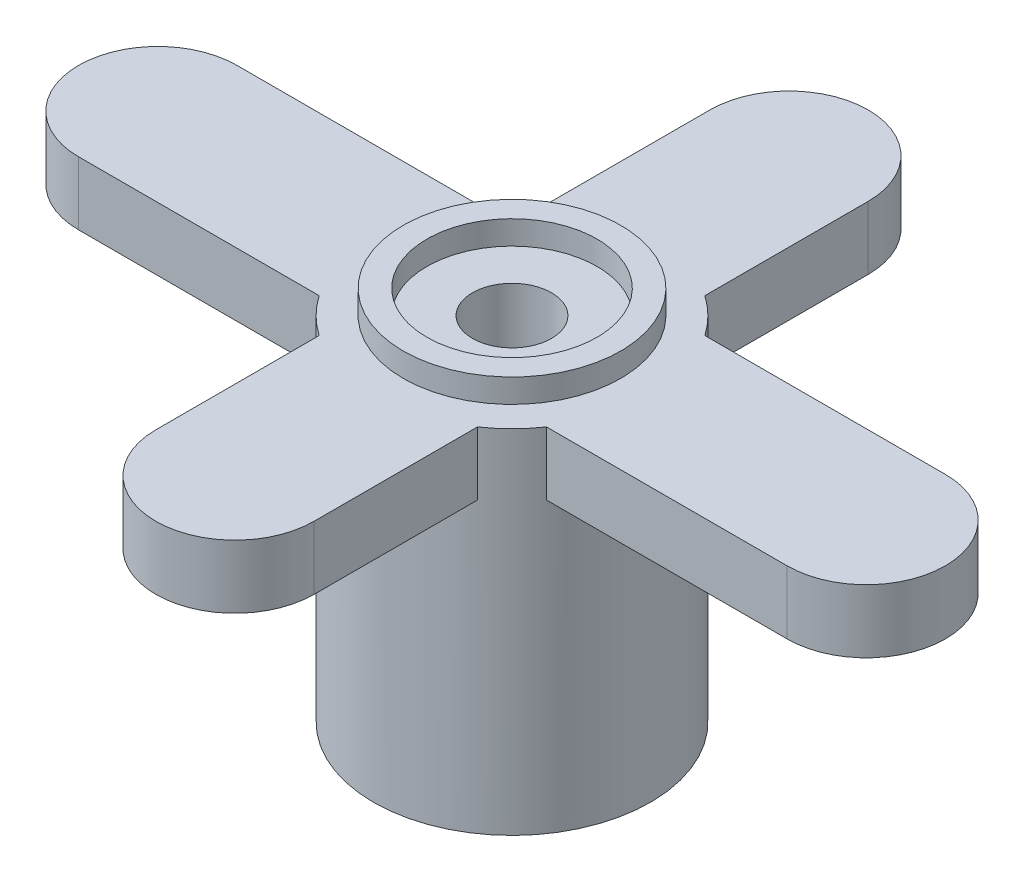
ISO-10303-21;
HEADER;
FILE_DESCRIPTION(('STEP AP214'),'2;1');
FILE_NAME('part.step','',(''),(''),'','','');
FILE_SCHEMA(('AUTOMOTIVE_DESIGN { 1 0 10303 214 1 1 1 1 }'));
ENDSEC;
DATA;
#1=APPLICATION_CONTEXT('core data for automotive mechanical design processes');
#2=APPLICATION_PROTOCOL_DEFINITION('international standard','automotive_design',2000,#1);
#3=PRODUCT_CONTEXT('',#1,'mechanical');
#4=PRODUCT('Part','Part','',(#3));
#5=PRODUCT_RELATED_PRODUCT_CATEGORY('part','',(#4));
#6=PRODUCT_DEFINITION_FORMATION('','',#4);
#7=PRODUCT_DEFINITION_CONTEXT('part definition',#1,'design');
#8=PRODUCT_DEFINITION('design','',#6,#7);
#9=PRODUCT_DEFINITION_SHAPE('','',#8);
#10=(LENGTH_UNIT() NAMED_UNIT(*) SI_UNIT(.MILLI.,.METRE.));
#11=(NAMED_UNIT(*) PLANE_ANGLE_UNIT() SI_UNIT($,.RADIAN.));
#12=(NAMED_UNIT(*) SI_UNIT($,.STERADIAN.) SOLID_ANGLE_UNIT());
#13=UNCERTAINTY_MEASURE_WITH_UNIT(LENGTH_MEASURE(1.E-05),#10,'distance_accuracy_value','');
#14=(GEOMETRIC_REPRESENTATION_CONTEXT(3) GLOBAL_UNCERTAINTY_ASSIGNED_CONTEXT((#13)) GLOBAL_UNIT_ASSIGNED_CONTEXT((#10,
#11,#12)) REPRESENTATION_CONTEXT('',''));
#15=CARTESIAN_POINT('',(0.,0.,0.));
#16=DIRECTION('',(0.,0.,1.));
#17=DIRECTION('',(1.,0.,0.));
#18=AXIS2_PLACEMENT_3D('',#15,#16,#17);
#19=CARTESIAN_POINT('',(0.,9.5,0.));
#20=DIRECTION('',(0.,-1.,0.));
#21=DIRECTION('',(0.,0.,-1.));
#22=AXIS2_PLACEMENT_3D('',#19,#20,#21);
#23=CYLINDRICAL_SURFACE('',#22,3.5);
#24=CARTESIAN_POINT('',(0.,0.,0.));
#25=DIRECTION('',(0.,1.,0.));
#26=DIRECTION('',(0.,0.,1.));
#27=AXIS2_PLACEMENT_3D('',#24,#25,#26);
#28=CIRCLE('',#27,3.5);
#29=CARTESIAN_POINT('',(0.,0.,3.5));
#30=VERTEX_POINT('',#29);
#31=EDGE_CURVE('E173',#30,#30,#28,.T.);
#32=ORIENTED_EDGE('',*,*,#31,.T.);
#33=EDGE_LOOP('',(#32));
#34=FACE_BOUND('',#33,.T.);
#35=CARTESIAN_POINT('',(0.,8.9,0.));
#36=DIRECTION('',(0.,1.,0.));
#37=DIRECTION('',(0.,0.,1.));
#38=AXIS2_PLACEMENT_3D('',#35,#36,#37);
#39=CIRCLE('',#38,3.5);
#40=CARTESIAN_POINT('',(2.87228132326901,8.9,2.));
#41=VERTEX_POINT('',#40);
#42=CARTESIAN_POINT('',(2.,8.9,2.87228132326901));
#43=VERTEX_POINT('',#42);
#44=EDGE_CURVE('E159',#41,#43,#39,.F.);
#45=ORIENTED_EDGE('',*,*,#44,.T.);
#46=DIRECTION('',(0.,-1.,0.));
#47=VECTOR('',#46,1.);
#48=CARTESIAN_POINT('',(2.,9.5,2.87228132326901));
#49=LINE('',#48,#47);
#50=CARTESIAN_POINT('',(2.,7.3,2.87228132326901));
#51=VERTEX_POINT('',#50);
#52=EDGE_CURVE('E198',#43,#51,#49,.T.);
#53=ORIENTED_EDGE('',*,*,#52,.T.);
#54=CARTESIAN_POINT('',(0.,7.3,0.));
#55=DIRECTION('',(0.,1.,0.));
#56=DIRECTION('',(0.,0.,1.));
#57=AXIS2_PLACEMENT_3D('',#54,#55,#56);
#58=CIRCLE('',#57,3.5);
#59=CARTESIAN_POINT('',(-2.,7.3,2.87228132326901));
#60=VERTEX_POINT('',#59);
#61=EDGE_CURVE('E11',#60,#51,#58,.T.);
#62=ORIENTED_EDGE('',*,*,#61,.F.);
#63=DIRECTION('',(0.,-1.,0.));
#64=VECTOR('',#63,1.);
#65=CARTESIAN_POINT('',(-2.,9.5,2.87228132326901));
#66=LINE('',#65,#64);
#67=CARTESIAN_POINT('',(-2.,8.9,2.87228132326901));
#68=VERTEX_POINT('',#67);
#69=EDGE_CURVE('E41',#68,#60,#66,.T.);
#70=ORIENTED_EDGE('',*,*,#69,.F.);
#71=CARTESIAN_POINT('',(-2.87228132326901,8.9,2.));
#72=VERTEX_POINT('',#71);
#73=EDGE_CURVE('E148',#68,#72,#39,.F.);
#74=ORIENTED_EDGE('',*,*,#73,.T.);
#75=DIRECTION('',(0.,-1.,0.));
#76=VECTOR('',#75,1.);
#77=CARTESIAN_POINT('',(-2.87228132326901,9.5,2.));
#78=LINE('',#77,#76);
#79=CARTESIAN_POINT('',(-2.87228132326901,7.3,2.));
#80=VERTEX_POINT('',#79);
#81=EDGE_CURVE('E151',#72,#80,#78,.T.);
#82=ORIENTED_EDGE('',*,*,#81,.T.);
#83=CARTESIAN_POINT('',(0.,7.3,0.));
#84=DIRECTION('',(0.,1.,0.));
#85=DIRECTION('',(0.,0.,1.));
#86=AXIS2_PLACEMENT_3D('',#83,#84,#85);
#87=CIRCLE('',#86,3.5);
#88=CARTESIAN_POINT('',(-2.87228132326901,7.3,-2.));
#89=VERTEX_POINT('',#88);
#90=EDGE_CURVE('E48',#89,#80,#87,.T.);
#91=ORIENTED_EDGE('',*,*,#90,.F.);
#92=DIRECTION('',(0.,-1.,0.));
#93=VECTOR('',#92,1.);
#94=CARTESIAN_POINT('',(-2.87228132326901,9.5,-2.));
#95=LINE('',#94,#93);
#96=CARTESIAN_POINT('',(-2.87228132326901,8.9,-2.));
#97=VERTEX_POINT('',#96);
#98=EDGE_CURVE('E56',#97,#89,#95,.T.);
#99=ORIENTED_EDGE('',*,*,#98,.F.);
#100=CARTESIAN_POINT('',(-2.,8.9,-2.87228132326901));
#101=VERTEX_POINT('',#100);
#102=EDGE_CURVE('E157',#97,#101,#39,.F.);
#103=ORIENTED_EDGE('',*,*,#102,.T.);
#104=DIRECTION('',(0.,-1.,0.));
#105=VECTOR('',#104,1.);
#106=CARTESIAN_POINT('',(-2.,9.5,-2.87228132326901));
#107=LINE('',#106,#105);
#108=CARTESIAN_POINT('',(-2.,7.3,-2.87228132326901));
#109=VERTEX_POINT('',#108);
#110=EDGE_CURVE('E182',#109,#101,#107,.F.);
#111=ORIENTED_EDGE('',*,*,#110,.F.);
#112=CARTESIAN_POINT('',(0.,7.3,0.));
#113=DIRECTION('',(0.,1.,0.));
#114=DIRECTION('',(0.,0.,1.));
#115=AXIS2_PLACEMENT_3D('',#112,#113,#114);
#116=CIRCLE('',#115,3.5);
#117=CARTESIAN_POINT('',(2.,7.3,-2.87228132326901));
#118=VERTEX_POINT('',#117);
#119=EDGE_CURVE('E188',#118,#109,#116,.T.);
#120=ORIENTED_EDGE('',*,*,#119,.F.);
#121=DIRECTION('',(0.,-1.,0.));
#122=VECTOR('',#121,1.);
#123=CARTESIAN_POINT('',(2.,9.5,-2.87228132326901));
#124=LINE('',#123,#122);
#125=CARTESIAN_POINT('',(2.,8.9,-2.87228132326901));
#126=VERTEX_POINT('',#125);
#127=EDGE_CURVE('E185',#118,#126,#124,.F.);
#128=ORIENTED_EDGE('',*,*,#127,.T.);
#129=CARTESIAN_POINT('',(2.87228132326901,8.9,-2.));
#130=VERTEX_POINT('',#129);
#131=EDGE_CURVE('E397',#126,#130,#39,.F.);
#132=ORIENTED_EDGE('',*,*,#131,.T.);
#133=DIRECTION('',(0.,-1.,0.));
#134=VECTOR('',#133,1.);
#135=CARTESIAN_POINT('',(2.87228132326901,9.5,-2.));
#136=LINE('',#135,#134);
#137=CARTESIAN_POINT('',(2.87228132326901,7.3,-2.));
#138=VERTEX_POINT('',#137);
#139=EDGE_CURVE('E190',#138,#130,#136,.F.);
#140=ORIENTED_EDGE('',*,*,#139,.F.);
#141=CARTESIAN_POINT('',(0.,7.3,0.));
#142=DIRECTION('',(0.,1.,0.));
#143=DIRECTION('',(0.,0.,1.));
#144=AXIS2_PLACEMENT_3D('',#141,#142,#143);
#145=CIRCLE('',#144,3.5);
#146=CARTESIAN_POINT('',(2.87228132326901,7.3,2.));
#147=VERTEX_POINT('',#146);
#148=EDGE_CURVE('E196',#147,#138,#145,.T.);
#149=ORIENTED_EDGE('',*,*,#148,.F.);
#150=DIRECTION('',(0.,-1.,0.));
#151=VECTOR('',#150,1.);
#152=CARTESIAN_POINT('',(2.87228132326901,9.5,2.));
#153=LINE('',#152,#151);
#154=EDGE_CURVE('E193',#147,#41,#153,.F.);
#155=ORIENTED_EDGE('',*,*,#154,.T.);
#156=EDGE_LOOP('',(#45,#53,#62,#70,#74,#82,#91,#99,#103,#111,#120,#128,#132,#140,#149,#155));
#157=FACE_BOUND('',#156,.T.);
#158=ADVANCED_FACE('F34',(#34,#157),#23,.T.);
#159=CARTESIAN_POINT('',(0.,9.5,0.));
#160=DIRECTION('',(0.,1.,0.));
#161=DIRECTION('',(0.,0.,1.));
#162=AXIS2_PLACEMENT_3D('',#159,#160,#161);
#163=PLANE('',#162);
#164=CARTESIAN_POINT('',(0.,9.5,0.));
#165=DIRECTION('',(0.,1.,0.));
#166=DIRECTION('',(0.,0.,1.));
#167=AXIS2_PLACEMENT_3D('',#164,#165,#166);
#168=CIRCLE('',#167,2.15);
#169=CARTESIAN_POINT('',(0.,9.5,2.15));
#170=VERTEX_POINT('',#169);
#171=EDGE_CURVE('E406',#170,#170,#168,.T.);
#172=ORIENTED_EDGE('',*,*,#171,.F.);
#173=EDGE_LOOP('',(#172));
#174=FACE_BOUND('',#173,.T.);
#175=CARTESIAN_POINT('',(0.,9.5,0.));
#176=DIRECTION('',(0.,1.,0.));
#177=DIRECTION('',(0.,0.,1.));
#178=AXIS2_PLACEMENT_3D('',#175,#176,#177);
#179=CIRCLE('',#178,2.75);
#180=CARTESIAN_POINT('',(0.,9.5,2.75));
#181=VERTEX_POINT('',#180);
#182=EDGE_CURVE('E395',#181,#181,#179,.T.);
#183=ORIENTED_EDGE('',*,*,#182,.T.);
#184=EDGE_LOOP('',(#183));
#185=FACE_BOUND('',#184,.T.);
#186=ADVANCED_FACE('F296',(#174,#185),#163,.T.);
#187=CARTESIAN_POINT('',(0.,0.,0.));
#188=DIRECTION('',(0.,1.,0.));
#189=DIRECTION('',(0.,0.,1.));
#190=AXIS2_PLACEMENT_3D('',#187,#188,#189);
#191=PLANE('',#190);
#192=CARTESIAN_POINT('',(0.,0.,0.));
#193=DIRECTION('',(0.,-1.,0.));
#194=DIRECTION('',(0.,0.,-1.));
#195=AXIS2_PLACEMENT_3D('',#192,#193,#194);
#196=CIRCLE('',#195,1.9);
#197=CARTESIAN_POINT('',(0.,0.,-1.9));
#198=VERTEX_POINT('',#197);
#199=EDGE_CURVE('E285',#198,#198,#196,.T.);
#200=ORIENTED_EDGE('',*,*,#199,.F.);
#201=EDGE_LOOP('',(#200));
#202=FACE_BOUND('',#201,.T.);
#203=ORIENTED_EDGE('',*,*,#31,.F.);
#204=EDGE_LOOP('',(#203));
#205=FACE_BOUND('',#204,.T.);
#206=ADVANCED_FACE('F293',(#202,#205),#191,.F.);
#207=CARTESIAN_POINT('',(0.,3.5,0.));
#208=DIRECTION('',(0.,-1.,0.));
#209=DIRECTION('',(0.,0.,-1.));
#210=AXIS2_PLACEMENT_3D('',#207,#208,#209);
#211=CYLINDRICAL_SURFACE('',#210,1.9);
#212=CARTESIAN_POINT('',(0.,3.5,0.));
#213=DIRECTION('',(0.,-1.,0.));
#214=DIRECTION('',(0.,0.,-1.));
#215=AXIS2_PLACEMENT_3D('',#212,#213,#214);
#216=CIRCLE('',#215,1.9);
#217=CARTESIAN_POINT('',(0.,3.5,-1.9));
#218=VERTEX_POINT('',#217);
#219=EDGE_CURVE('E177',#218,#218,#216,.T.);
#220=ORIENTED_EDGE('',*,*,#219,.F.);
#221=EDGE_LOOP('',(#220));
#222=FACE_BOUND('',#221,.T.);
#223=ORIENTED_EDGE('',*,*,#199,.T.);
#224=EDGE_LOOP('',(#223));
#225=FACE_BOUND('',#224,.T.);
#226=ADVANCED_FACE('F291',(#222,#225),#211,.F.);
#227=CARTESIAN_POINT('',(0.,3.5,0.));
#228=DIRECTION('',(0.,-1.,0.));
#229=DIRECTION('',(0.,0.,-1.));
#230=AXIS2_PLACEMENT_3D('',#227,#228,#229);
#231=PLANE('',#230);
#232=CARTESIAN_POINT('',(0.,3.5,0.));
#233=DIRECTION('',(0.,-1.,0.));
#234=DIRECTION('',(0.,0.,-1.));
#235=AXIS2_PLACEMENT_3D('',#232,#233,#234);
#236=CIRCLE('',#235,1.);
#237=CARTESIAN_POINT('',(0.,3.5,-1.));
#238=VERTEX_POINT('',#237);
#239=EDGE_CURVE('E403',#238,#238,#236,.T.);
#240=ORIENTED_EDGE('',*,*,#239,.F.);
#241=EDGE_LOOP('',(#240));
#242=FACE_BOUND('',#241,.T.);
#243=ORIENTED_EDGE('',*,*,#219,.T.);
#244=EDGE_LOOP('',(#243));
#245=FACE_BOUND('',#244,.T.);
#246=ADVANCED_FACE('F312',(#242,#245),#231,.T.);
#247=CARTESIAN_POINT('',(0.,7.3,-2.));
#248=DIRECTION('',(0.,0.,1.));
#249=DIRECTION('',(1.,0.,0.));
#250=AXIS2_PLACEMENT_3D('',#247,#248,#249);
#251=PLANE('',#250);
#252=DIRECTION('',(1.,0.,0.));
#253=VECTOR('',#252,1.);
#254=CARTESIAN_POINT('',(0.,8.9,-2.));
#255=LINE('',#254,#253);
#256=CARTESIAN_POINT('',(-8.95,8.9,-2.));
#257=VERTEX_POINT('',#256);
#258=EDGE_CURVE('E169',#257,#97,#255,.T.);
#259=ORIENTED_EDGE('',*,*,#258,.T.);
#260=ORIENTED_EDGE('',*,*,#98,.T.);
#261=DIRECTION('',(1.,0.,0.));
#262=VECTOR('',#261,1.);
#263=CARTESIAN_POINT('',(0.,7.3,-2.));
#264=LINE('',#263,#262);
#265=CARTESIAN_POINT('',(-8.95,7.3,-2.));
#266=VERTEX_POINT('',#265);
#267=EDGE_CURVE('E278',#266,#89,#264,.T.);
#268=ORIENTED_EDGE('',*,*,#267,.F.);
#269=DIRECTION('',(0.,1.,0.));
#270=VECTOR('',#269,1.);
#271=CARTESIAN_POINT('',(-8.95,7.3,-2.));
#272=LINE('',#271,#270);
#273=EDGE_CURVE('E283',#266,#257,#272,.T.);
#274=ORIENTED_EDGE('',*,*,#273,.T.);
#275=EDGE_LOOP('',(#259,#260,#268,#274));
#276=FACE_BOUND('',#275,.T.);
#277=ADVANCED_FACE('F316',(#276),#251,.F.);
#278=CARTESIAN_POINT('',(0.,7.3,2.));
#279=DIRECTION('',(0.,0.,1.));
#280=DIRECTION('',(1.,0.,0.));
#281=AXIS2_PLACEMENT_3D('',#278,#279,#280);
#282=PLANE('',#281);
#283=ORIENTED_EDGE('',*,*,#81,.F.);
#284=DIRECTION('',(1.,0.,0.));
#285=VECTOR('',#284,1.);
#286=CARTESIAN_POINT('',(0.,8.9,2.));
#287=LINE('',#286,#285);
#288=CARTESIAN_POINT('',(-8.95,8.9,2.));
#289=VERTEX_POINT('',#288);
#290=EDGE_CURVE('E162',#289,#72,#287,.T.);
#291=ORIENTED_EDGE('',*,*,#290,.F.);
#292=DIRECTION('',(0.,1.,0.));
#293=VECTOR('',#292,1.);
#294=CARTESIAN_POINT('',(-8.95,7.3,2.));
#295=LINE('',#294,#293);
#296=CARTESIAN_POINT('',(-8.95,7.3,2.));
#297=VERTEX_POINT('',#296);
#298=EDGE_CURVE('E280',#297,#289,#295,.T.);
#299=ORIENTED_EDGE('',*,*,#298,.F.);
#300=DIRECTION('',(1.,0.,0.));
#301=VECTOR('',#300,1.);
#302=CARTESIAN_POINT('',(0.,7.3,2.));
#303=LINE('',#302,#301);
#304=EDGE_CURVE('E172',#297,#80,#303,.T.);
#305=ORIENTED_EDGE('',*,*,#304,.T.);
#306=EDGE_LOOP('',(#283,#291,#299,#305));
#307=FACE_BOUND('',#306,.T.);
#308=ADVANCED_FACE('F171',(#307),#282,.T.);
#309=CARTESIAN_POINT('',(-8.95,7.3,0.));
#310=DIRECTION('',(0.,1.,0.));
#311=DIRECTION('',(0.,0.,1.));
#312=AXIS2_PLACEMENT_3D('',#309,#310,#311);
#313=CYLINDRICAL_SURFACE('',#312,2.);
#314=CARTESIAN_POINT('',(-8.95,8.9,0.));
#315=DIRECTION('',(0.,1.,0.));
#316=DIRECTION('',(0.,0.,1.));
#317=AXIS2_PLACEMENT_3D('',#314,#315,#316);
#318=CIRCLE('',#317,2.);
#319=EDGE_CURVE('E167',#257,#289,#318,.T.);
#320=ORIENTED_EDGE('',*,*,#319,.F.);
#321=ORIENTED_EDGE('',*,*,#273,.F.);
#322=CARTESIAN_POINT('',(-8.95,7.3,0.));
#323=DIRECTION('',(0.,1.,0.));
#324=DIRECTION('',(0.,0.,1.));
#325=AXIS2_PLACEMENT_3D('',#322,#323,#324);
#326=CIRCLE('',#325,2.);
#327=EDGE_CURVE('E274',#266,#297,#326,.T.);
#328=ORIENTED_EDGE('',*,*,#327,.T.);
#329=ORIENTED_EDGE('',*,*,#298,.T.);
#330=EDGE_LOOP('',(#320,#321,#328,#329));
#331=FACE_BOUND('',#330,.T.);
#332=ADVANCED_FACE('F318',(#331),#313,.T.);
#333=CARTESIAN_POINT('',(0.,7.3,0.));
#334=DIRECTION('',(0.,1.,0.));
#335=DIRECTION('',(0.,0.,1.));
#336=AXIS2_PLACEMENT_3D('',#333,#334,#335);
#337=PLANE('',#336);
#338=ORIENTED_EDGE('',*,*,#267,.T.);
#339=ORIENTED_EDGE('',*,*,#90,.T.);
#340=ORIENTED_EDGE('',*,*,#304,.F.);
#341=ORIENTED_EDGE('',*,*,#327,.F.);
#342=EDGE_LOOP('',(#338,#339,#340,#341));
#343=FACE_BOUND('',#342,.T.);
#344=ADVANCED_FACE('F321',(#343),#337,.F.);
#345=CARTESIAN_POINT('',(0.,8.9,0.));
#346=DIRECTION('',(0.,1.,0.));
#347=DIRECTION('',(0.,0.,1.));
#348=AXIS2_PLACEMENT_3D('',#345,#346,#347);
#349=PLANE('',#348);
#350=ORIENTED_EDGE('',*,*,#290,.T.);
#351=ORIENTED_EDGE('',*,*,#73,.F.);
#352=DIRECTION('',(0.,0.,-1.));
#353=VECTOR('',#352,1.);
#354=CARTESIAN_POINT('',(-2.,8.9,0.));
#355=LINE('',#354,#353);
#356=CARTESIAN_POINT('',(-2.,8.9,7.));
#357=VERTEX_POINT('',#356);
#358=EDGE_CURVE('E206',#357,#68,#355,.T.);
#359=ORIENTED_EDGE('',*,*,#358,.F.);
#360=CARTESIAN_POINT('',(0.,8.9,7.));
#361=DIRECTION('',(0.,1.,0.));
#362=DIRECTION('',(0.,0.,1.));
#363=AXIS2_PLACEMENT_3D('',#360,#361,#362);
#364=CIRCLE('',#363,2.);
#365=CARTESIAN_POINT('',(2.,8.9,7.));
#366=VERTEX_POINT('',#365);
#367=EDGE_CURVE('E213',#357,#366,#364,.T.);
#368=ORIENTED_EDGE('',*,*,#367,.T.);
#369=DIRECTION('',(0.,0.,-1.));
#370=VECTOR('',#369,1.);
#371=CARTESIAN_POINT('',(2.,8.9,0.));
#372=LINE('',#371,#370);
#373=EDGE_CURVE('E221',#366,#43,#372,.T.);
#374=ORIENTED_EDGE('',*,*,#373,.T.);
#375=ORIENTED_EDGE('',*,*,#44,.F.);
#376=DIRECTION('',(1.,0.,0.));
#377=VECTOR('',#376,1.);
#378=CARTESIAN_POINT('',(0.,8.9,2.));
#379=LINE('',#378,#377);
#380=CARTESIAN_POINT('',(8.95,8.9,2.));
#381=VERTEX_POINT('',#380);
#382=EDGE_CURVE('E249',#41,#381,#379,.T.);
#383=ORIENTED_EDGE('',*,*,#382,.T.);
#384=CARTESIAN_POINT('',(8.95,8.9,0.));
#385=DIRECTION('',(0.,1.,0.));
#386=DIRECTION('',(0.,0.,1.));
#387=AXIS2_PLACEMENT_3D('',#384,#385,#386);
#388=CIRCLE('',#387,2.);
#389=CARTESIAN_POINT('',(8.95,8.9,-2.));
#390=VERTEX_POINT('',#389);
#391=EDGE_CURVE('E245',#381,#390,#388,.T.);
#392=ORIENTED_EDGE('',*,*,#391,.T.);
#393=DIRECTION('',(1.,0.,0.));
#394=VECTOR('',#393,1.);
#395=CARTESIAN_POINT('',(0.,8.9,-2.));
#396=LINE('',#395,#394);
#397=EDGE_CURVE('E238',#130,#390,#396,.T.);
#398=ORIENTED_EDGE('',*,*,#397,.F.);
#399=ORIENTED_EDGE('',*,*,#131,.F.);
#400=DIRECTION('',(0.,0.,-1.));
#401=VECTOR('',#400,1.);
#402=CARTESIAN_POINT('',(2.,8.9,0.));
#403=LINE('',#402,#401);
#404=CARTESIAN_POINT('',(2.,8.9,-7.));
#405=VERTEX_POINT('',#404);
#406=EDGE_CURVE('E268',#126,#405,#403,.T.);
#407=ORIENTED_EDGE('',*,*,#406,.T.);
#408=CARTESIAN_POINT('',(0.,8.9,-7.));
#409=DIRECTION('',(0.,1.,0.));
#410=DIRECTION('',(0.,0.,1.));
#411=AXIS2_PLACEMENT_3D('',#408,#409,#410);
#412=CIRCLE('',#411,2.);
#413=CARTESIAN_POINT('',(-2.,8.9,-7.));
#414=VERTEX_POINT('',#413);
#415=EDGE_CURVE('E265',#405,#414,#412,.T.);
#416=ORIENTED_EDGE('',*,*,#415,.T.);
#417=DIRECTION('',(0.,0.,-1.));
#418=VECTOR('',#417,1.);
#419=CARTESIAN_POINT('',(-2.,8.9,0.));
#420=LINE('',#419,#418);
#421=EDGE_CURVE('E258',#101,#414,#420,.T.);
#422=ORIENTED_EDGE('',*,*,#421,.F.);
#423=ORIENTED_EDGE('',*,*,#102,.F.);
#424=ORIENTED_EDGE('',*,*,#258,.F.);
#425=ORIENTED_EDGE('',*,*,#319,.T.);
#426=EDGE_LOOP('',(#350,#351,#359,#368,#374,#375,#383,#392,#398,#399,#407,#416,#422,#423,#424,#425));
#427=FACE_BOUND('',#426,.T.);
#428=CARTESIAN_POINT('',(0.,8.9,0.));
#429=DIRECTION('',(0.,1.,0.));
#430=DIRECTION('',(0.,0.,1.));
#431=AXIS2_PLACEMENT_3D('',#428,#429,#430);
#432=CIRCLE('',#431,2.75);
#433=CARTESIAN_POINT('',(0.,8.9,2.75));
#434=VERTEX_POINT('',#433);
#435=EDGE_CURVE('E156',#434,#434,#432,.F.);
#436=ORIENTED_EDGE('',*,*,#435,.T.);
#437=EDGE_LOOP('',(#436));
#438=FACE_BOUND('',#437,.T.);
#439=ADVANCED_FACE('F163',(#427,#438),#349,.T.);
#440=CARTESIAN_POINT('',(2.,7.3,0.));
#441=DIRECTION('',(1.,0.,0.));
#442=DIRECTION('',(0.,0.,-1.));
#443=AXIS2_PLACEMENT_3D('',#440,#441,#442);
#444=PLANE('',#443);
#445=ORIENTED_EDGE('',*,*,#127,.F.);
#446=DIRECTION('',(0.,0.,-1.));
#447=VECTOR('',#446,1.);
#448=CARTESIAN_POINT('',(2.,7.3,0.));
#449=LINE('',#448,#447);
#450=CARTESIAN_POINT('',(2.,7.3,-7.));
#451=VERTEX_POINT('',#450);
#452=EDGE_CURVE('E248',#118,#451,#449,.T.);
#453=ORIENTED_EDGE('',*,*,#452,.T.);
#454=DIRECTION('',(0.,1.,0.));
#455=VECTOR('',#454,1.);
#456=CARTESIAN_POINT('',(2.,7.3,-7.));
#457=LINE('',#456,#455);
#458=EDGE_CURVE('E255',#451,#405,#457,.T.);
#459=ORIENTED_EDGE('',*,*,#458,.T.);
#460=ORIENTED_EDGE('',*,*,#406,.F.);
#461=EDGE_LOOP('',(#445,#453,#459,#460));
#462=FACE_BOUND('',#461,.T.);
#463=ADVANCED_FACE('F329',(#462),#444,.T.);
#464=CARTESIAN_POINT('',(-2.,7.3,0.));
#465=DIRECTION('',(1.,0.,0.));
#466=DIRECTION('',(0.,0.,-1.));
#467=AXIS2_PLACEMENT_3D('',#464,#465,#466);
#468=PLANE('',#467);
#469=DIRECTION('',(0.,0.,-1.));
#470=VECTOR('',#469,1.);
#471=CARTESIAN_POINT('',(-2.,7.3,0.));
#472=LINE('',#471,#470);
#473=CARTESIAN_POINT('',(-2.,7.3,-7.));
#474=VERTEX_POINT('',#473);
#475=EDGE_CURVE('E262',#109,#474,#472,.T.);
#476=ORIENTED_EDGE('',*,*,#475,.F.);
#477=ORIENTED_EDGE('',*,*,#110,.T.);
#478=ORIENTED_EDGE('',*,*,#421,.T.);
#479=DIRECTION('',(0.,1.,0.));
#480=VECTOR('',#479,1.);
#481=CARTESIAN_POINT('',(-2.,7.3,-7.));
#482=LINE('',#481,#480);
#483=EDGE_CURVE('E259',#474,#414,#482,.T.);
#484=ORIENTED_EDGE('',*,*,#483,.F.);
#485=EDGE_LOOP('',(#476,#477,#478,#484));
#486=FACE_BOUND('',#485,.T.);
#487=ADVANCED_FACE('F338',(#486),#468,.F.);
#488=CARTESIAN_POINT('',(0.,7.3,-7.));
#489=DIRECTION('',(0.,1.,0.));
#490=DIRECTION('',(0.,0.,1.));
#491=AXIS2_PLACEMENT_3D('',#488,#489,#490);
#492=CYLINDRICAL_SURFACE('',#491,2.);
#493=ORIENTED_EDGE('',*,*,#415,.F.);
#494=ORIENTED_EDGE('',*,*,#458,.F.);
#495=CARTESIAN_POINT('',(0.,7.3,-7.));
#496=DIRECTION('',(0.,1.,0.));
#497=DIRECTION('',(0.,0.,1.));
#498=AXIS2_PLACEMENT_3D('',#495,#496,#497);
#499=CIRCLE('',#498,2.);
#500=EDGE_CURVE('E263',#451,#474,#499,.T.);
#501=ORIENTED_EDGE('',*,*,#500,.T.);
#502=ORIENTED_EDGE('',*,*,#483,.T.);
#503=EDGE_LOOP('',(#493,#494,#501,#502));
#504=FACE_BOUND('',#503,.T.);
#505=ADVANCED_FACE('F336',(#504),#492,.T.);
#506=CARTESIAN_POINT('',(0.,7.3,0.));
#507=DIRECTION('',(0.,1.,0.));
#508=DIRECTION('',(0.,0.,1.));
#509=AXIS2_PLACEMENT_3D('',#506,#507,#508);
#510=PLANE('',#509);
#511=ORIENTED_EDGE('',*,*,#452,.F.);
#512=ORIENTED_EDGE('',*,*,#119,.T.);
#513=ORIENTED_EDGE('',*,*,#475,.T.);
#514=ORIENTED_EDGE('',*,*,#500,.F.);
#515=EDGE_LOOP('',(#511,#512,#513,#514));
#516=FACE_BOUND('',#515,.T.);
#517=ADVANCED_FACE('F332',(#516),#510,.F.);
#518=CARTESIAN_POINT('',(0.,7.3,2.));
#519=DIRECTION('',(0.,0.,1.));
#520=DIRECTION('',(1.,0.,0.));
#521=AXIS2_PLACEMENT_3D('',#518,#519,#520);
#522=PLANE('',#521);
#523=ORIENTED_EDGE('',*,*,#154,.F.);
#524=DIRECTION('',(1.,0.,0.));
#525=VECTOR('',#524,1.);
#526=CARTESIAN_POINT('',(0.,7.3,2.));
#527=LINE('',#526,#525);
#528=CARTESIAN_POINT('',(8.95,7.3,2.));
#529=VERTEX_POINT('',#528);
#530=EDGE_CURVE('E232',#147,#529,#527,.T.);
#531=ORIENTED_EDGE('',*,*,#530,.T.);
#532=DIRECTION('',(0.,1.,0.));
#533=VECTOR('',#532,1.);
#534=CARTESIAN_POINT('',(8.95,7.3,2.));
#535=LINE('',#534,#533);
#536=EDGE_CURVE('E235',#529,#381,#535,.T.);
#537=ORIENTED_EDGE('',*,*,#536,.T.);
#538=ORIENTED_EDGE('',*,*,#382,.F.);
#539=EDGE_LOOP('',(#523,#531,#537,#538));
#540=FACE_BOUND('',#539,.T.);
#541=ADVANCED_FACE('F335',(#540),#522,.T.);
#542=CARTESIAN_POINT('',(0.,7.3,-2.));
#543=DIRECTION('',(0.,0.,1.));
#544=DIRECTION('',(1.,0.,0.));
#545=AXIS2_PLACEMENT_3D('',#542,#543,#544);
#546=PLANE('',#545);
#547=DIRECTION('',(1.,0.,0.));
#548=VECTOR('',#547,1.);
#549=CARTESIAN_POINT('',(0.,7.3,-2.));
#550=LINE('',#549,#548);
#551=CARTESIAN_POINT('',(8.95,7.3,-2.));
#552=VERTEX_POINT('',#551);
#553=EDGE_CURVE('E242',#138,#552,#550,.T.);
#554=ORIENTED_EDGE('',*,*,#553,.F.);
#555=ORIENTED_EDGE('',*,*,#139,.T.);
#556=ORIENTED_EDGE('',*,*,#397,.T.);
#557=DIRECTION('',(0.,1.,0.));
#558=VECTOR('',#557,1.);
#559=CARTESIAN_POINT('',(8.95,7.3,-2.));
#560=LINE('',#559,#558);
#561=EDGE_CURVE('E239',#552,#390,#560,.T.);
#562=ORIENTED_EDGE('',*,*,#561,.F.);
#563=EDGE_LOOP('',(#554,#555,#556,#562));
#564=FACE_BOUND('',#563,.T.);
#565=ADVANCED_FACE('F353',(#564),#546,.F.);
#566=CARTESIAN_POINT('',(8.95,7.3,0.));
#567=DIRECTION('',(0.,1.,0.));
#568=DIRECTION('',(0.,0.,1.));
#569=AXIS2_PLACEMENT_3D('',#566,#567,#568);
#570=CYLINDRICAL_SURFACE('',#569,2.);
#571=ORIENTED_EDGE('',*,*,#391,.F.);
#572=ORIENTED_EDGE('',*,*,#536,.F.);
#573=CARTESIAN_POINT('',(8.95,7.3,0.));
#574=DIRECTION('',(0.,1.,0.));
#575=DIRECTION('',(0.,0.,1.));
#576=AXIS2_PLACEMENT_3D('',#573,#574,#575);
#577=CIRCLE('',#576,2.);
#578=EDGE_CURVE('E243',#529,#552,#577,.T.);
#579=ORIENTED_EDGE('',*,*,#578,.T.);
#580=ORIENTED_EDGE('',*,*,#561,.T.);
#581=EDGE_LOOP('',(#571,#572,#579,#580));
#582=FACE_BOUND('',#581,.T.);
#583=ADVANCED_FACE('F351',(#582),#570,.T.);
#584=CARTESIAN_POINT('',(0.,7.3,0.));
#585=DIRECTION('',(0.,1.,0.));
#586=DIRECTION('',(0.,0.,1.));
#587=AXIS2_PLACEMENT_3D('',#584,#585,#586);
#588=PLANE('',#587);
#589=ORIENTED_EDGE('',*,*,#530,.F.);
#590=ORIENTED_EDGE('',*,*,#148,.T.);
#591=ORIENTED_EDGE('',*,*,#553,.T.);
#592=ORIENTED_EDGE('',*,*,#578,.F.);
#593=EDGE_LOOP('',(#589,#590,#591,#592));
#594=FACE_BOUND('',#593,.T.);
#595=ADVANCED_FACE('F348',(#594),#588,.F.);
#596=CARTESIAN_POINT('',(-2.,7.3,0.));
#597=DIRECTION('',(1.,0.,0.));
#598=DIRECTION('',(0.,0.,-1.));
#599=AXIS2_PLACEMENT_3D('',#596,#597,#598);
#600=PLANE('',#599);
#601=ORIENTED_EDGE('',*,*,#358,.T.);
#602=ORIENTED_EDGE('',*,*,#69,.T.);
#603=DIRECTION('',(0.,0.,-1.));
#604=VECTOR('',#603,1.);
#605=CARTESIAN_POINT('',(-2.,7.3,0.));
#606=LINE('',#605,#604);
#607=CARTESIAN_POINT('',(-2.,7.3,7.));
#608=VERTEX_POINT('',#607);
#609=EDGE_CURVE('E204',#608,#60,#606,.T.);
#610=ORIENTED_EDGE('',*,*,#609,.F.);
#611=DIRECTION('',(0.,1.,0.));
#612=VECTOR('',#611,1.);
#613=CARTESIAN_POINT('',(-2.,7.3,7.));
#614=LINE('',#613,#612);
#615=EDGE_CURVE('E224',#608,#357,#614,.T.);
#616=ORIENTED_EDGE('',*,*,#615,.T.);
#617=EDGE_LOOP('',(#601,#602,#610,#616));
#618=FACE_BOUND('',#617,.T.);
#619=ADVANCED_FACE('F203',(#618),#600,.F.);
#620=CARTESIAN_POINT('',(2.,7.3,0.));
#621=DIRECTION('',(1.,0.,0.));
#622=DIRECTION('',(0.,0.,-1.));
#623=AXIS2_PLACEMENT_3D('',#620,#621,#622);
#624=PLANE('',#623);
#625=ORIENTED_EDGE('',*,*,#52,.F.);
#626=ORIENTED_EDGE('',*,*,#373,.F.);
#627=DIRECTION('',(0.,1.,0.));
#628=VECTOR('',#627,1.);
#629=CARTESIAN_POINT('',(2.,7.3,7.));
#630=LINE('',#629,#628);
#631=CARTESIAN_POINT('',(2.,7.3,7.));
#632=VERTEX_POINT('',#631);
#633=EDGE_CURVE('E223',#632,#366,#630,.T.);
#634=ORIENTED_EDGE('',*,*,#633,.F.);
#635=DIRECTION('',(0.,0.,-1.));
#636=VECTOR('',#635,1.);
#637=CARTESIAN_POINT('',(2.,7.3,0.));
#638=LINE('',#637,#636);
#639=EDGE_CURVE('E214',#632,#51,#638,.T.);
#640=ORIENTED_EDGE('',*,*,#639,.T.);
#641=EDGE_LOOP('',(#625,#626,#634,#640));
#642=FACE_BOUND('',#641,.T.);
#643=ADVANCED_FACE('F220',(#642),#624,.T.);
#644=CARTESIAN_POINT('',(0.,7.3,7.));
#645=DIRECTION('',(0.,1.,0.));
#646=DIRECTION('',(0.,0.,1.));
#647=AXIS2_PLACEMENT_3D('',#644,#645,#646);
#648=CYLINDRICAL_SURFACE('',#647,2.);
#649=ORIENTED_EDGE('',*,*,#367,.F.);
#650=ORIENTED_EDGE('',*,*,#615,.F.);
#651=CARTESIAN_POINT('',(0.,7.3,7.));
#652=DIRECTION('',(0.,1.,0.));
#653=DIRECTION('',(0.,0.,1.));
#654=AXIS2_PLACEMENT_3D('',#651,#652,#653);
#655=CIRCLE('',#654,2.);
#656=EDGE_CURVE('E212',#608,#632,#655,.T.);
#657=ORIENTED_EDGE('',*,*,#656,.T.);
#658=ORIENTED_EDGE('',*,*,#633,.T.);
#659=EDGE_LOOP('',(#649,#650,#657,#658));
#660=FACE_BOUND('',#659,.T.);
#661=ADVANCED_FACE('F363',(#660),#648,.T.);
#662=CARTESIAN_POINT('',(0.,7.3,0.));
#663=DIRECTION('',(0.,1.,0.));
#664=DIRECTION('',(0.,0.,1.));
#665=AXIS2_PLACEMENT_3D('',#662,#663,#664);
#666=PLANE('',#665);
#667=ORIENTED_EDGE('',*,*,#609,.T.);
#668=ORIENTED_EDGE('',*,*,#61,.T.);
#669=ORIENTED_EDGE('',*,*,#639,.F.);
#670=ORIENTED_EDGE('',*,*,#656,.F.);
#671=EDGE_LOOP('',(#667,#668,#669,#670));
#672=FACE_BOUND('',#671,.T.);
#673=ADVANCED_FACE('F208',(#672),#666,.F.);
#674=CARTESIAN_POINT('',(0.,2.81888168179569,0.));
#675=DIRECTION('',(0.,1.,0.));
#676=DIRECTION('',(0.,0.,1.));
#677=AXIS2_PLACEMENT_3D('',#674,#675,#676);
#678=CYLINDRICAL_SURFACE('',#677,2.15);
#679=CARTESIAN_POINT('',(0.,8.9,0.));
#680=DIRECTION('',(0.,1.,0.));
#681=DIRECTION('',(0.,0.,1.));
#682=AXIS2_PLACEMENT_3D('',#679,#680,#681);
#683=CIRCLE('',#682,2.15);
#684=CARTESIAN_POINT('',(0.,8.9,2.15));
#685=VERTEX_POINT('',#684);
#686=EDGE_CURVE('E408',#685,#685,#683,.F.);
#687=ORIENTED_EDGE('',*,*,#686,.T.);
#688=EDGE_LOOP('',(#687));
#689=FACE_BOUND('',#688,.T.);
#690=ORIENTED_EDGE('',*,*,#171,.T.);
#691=EDGE_LOOP('',(#690));
#692=FACE_BOUND('',#691,.T.);
#693=ADVANCED_FACE('F373',(#689,#692),#678,.F.);
#694=CARTESIAN_POINT('',(0.,8.9,0.));
#695=DIRECTION('',(0.,1.,0.));
#696=DIRECTION('',(0.,0.,1.));
#697=AXIS2_PLACEMENT_3D('',#694,#695,#696);
#698=PLANE('',#697);
#699=CARTESIAN_POINT('',(0.,8.9,0.));
#700=DIRECTION('',(0.,1.,0.));
#701=DIRECTION('',(0.,0.,1.));
#702=AXIS2_PLACEMENT_3D('',#699,#700,#701);
#703=CIRCLE('',#702,1.);
#704=CARTESIAN_POINT('',(0.,8.9,1.));
#705=VERTEX_POINT('',#704);
#706=EDGE_CURVE('E400',#705,#705,#703,.T.);
#707=ORIENTED_EDGE('',*,*,#706,.F.);
#708=EDGE_LOOP('',(#707));
#709=FACE_BOUND('',#708,.T.);
#710=ORIENTED_EDGE('',*,*,#686,.F.);
#711=EDGE_LOOP('',(#710));
#712=FACE_BOUND('',#711,.T.);
#713=ADVANCED_FACE('F376',(#709,#712),#698,.T.);
#714=CARTESIAN_POINT('',(0.,-22.7,0.));
#715=DIRECTION('',(0.,1.,0.));
#716=DIRECTION('',(0.,0.,1.));
#717=AXIS2_PLACEMENT_3D('',#714,#715,#716);
#718=CYLINDRICAL_SURFACE('',#717,1.);
#719=ORIENTED_EDGE('',*,*,#239,.T.);
#720=EDGE_LOOP('',(#719));
#721=FACE_BOUND('',#720,.T.);
#722=ORIENTED_EDGE('',*,*,#706,.T.);
#723=EDGE_LOOP('',(#722));
#724=FACE_BOUND('',#723,.T.);
#725=ADVANCED_FACE('F380',(#721,#724),#718,.F.);
#726=CARTESIAN_POINT('',(0.,-0.999494936611667,0.));
#727=DIRECTION('',(0.,1.,0.));
#728=DIRECTION('',(0.,0.,1.));
#729=AXIS2_PLACEMENT_3D('',#726,#727,#728);
#730=CYLINDRICAL_SURFACE('',#729,2.75);
#731=ORIENTED_EDGE('',*,*,#435,.F.);
#732=EDGE_LOOP('',(#731));
#733=FACE_BOUND('',#732,.T.);
#734=ORIENTED_EDGE('',*,*,#182,.F.);
#735=EDGE_LOOP('',(#734));
#736=FACE_BOUND('',#735,.T.);
#737=ADVANCED_FACE('F384',(#733,#736),#730,.T.);
#738=CLOSED_SHELL('',(#158,#186,#206,#226,#246,#277,#308,#332,#344,#439,#463,#487,#505,#517,
#541,#565,#583,#595,#619,#643,#661,#673,#693,#713,#725,#737));
#739=MANIFOLD_SOLID_BREP('B2',#738);
#740=ADVANCED_BREP_SHAPE_REPRESENTATION('',(#18,#739),#14);
#741=SHAPE_DEFINITION_REPRESENTATION(#9,#740);
ENDSEC;
END-ISO-10303-21;
